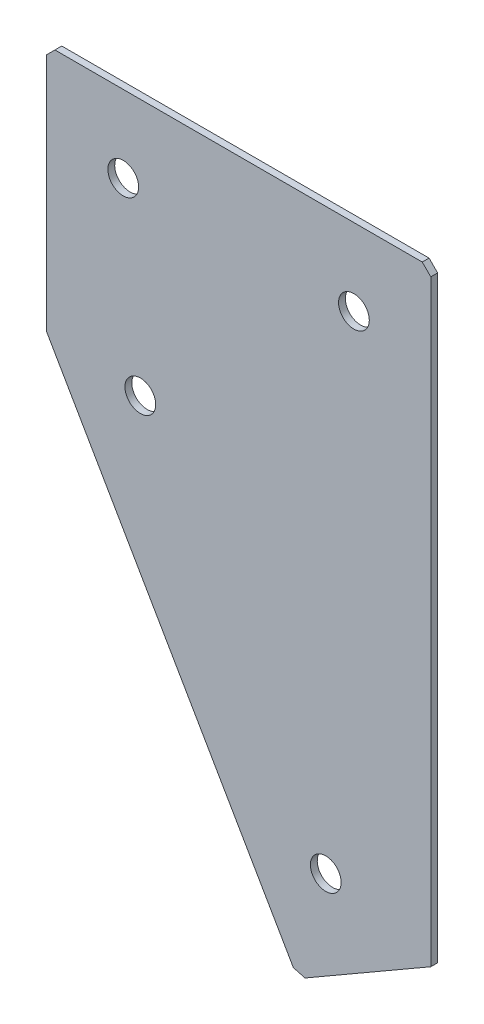
ISO-10303-21;
HEADER;
FILE_DESCRIPTION(('STEP AP214'),'2;1');
FILE_NAME('part.step','',(''),(''),'','','');
FILE_SCHEMA(('AUTOMOTIVE_DESIGN { 1 0 10303 214 1 1 1 1 }'));
ENDSEC;
DATA;
#1=APPLICATION_CONTEXT('core data for automotive mechanical design processes');
#2=APPLICATION_PROTOCOL_DEFINITION('international standard','automotive_design',2000,#1);
#3=PRODUCT_CONTEXT('',#1,'mechanical');
#4=PRODUCT('Part','Part','',(#3));
#5=PRODUCT_RELATED_PRODUCT_CATEGORY('part','',(#4));
#6=PRODUCT_DEFINITION_FORMATION('','',#4);
#7=PRODUCT_DEFINITION_CONTEXT('part definition',#1,'design');
#8=PRODUCT_DEFINITION('design','',#6,#7);
#9=PRODUCT_DEFINITION_SHAPE('','',#8);
#10=(LENGTH_UNIT() NAMED_UNIT(*) SI_UNIT(.MILLI.,.METRE.));
#11=(NAMED_UNIT(*) PLANE_ANGLE_UNIT() SI_UNIT($,.RADIAN.));
#12=(NAMED_UNIT(*) SI_UNIT($,.STERADIAN.) SOLID_ANGLE_UNIT());
#13=UNCERTAINTY_MEASURE_WITH_UNIT(LENGTH_MEASURE(1.E-05),#10,'distance_accuracy_value','');
#14=(GEOMETRIC_REPRESENTATION_CONTEXT(3) GLOBAL_UNCERTAINTY_ASSIGNED_CONTEXT((#13)) GLOBAL_UNIT_ASSIGNED_CONTEXT((#10,
#11,#12)) REPRESENTATION_CONTEXT('',''));
#15=CARTESIAN_POINT('',(0.,0.,0.));
#16=DIRECTION('',(0.,0.,1.));
#17=DIRECTION('',(1.,0.,0.));
#18=AXIS2_PLACEMENT_3D('',#15,#16,#17);
#19=CARTESIAN_POINT('',(0.,0.,-2.));
#20=DIRECTION('',(1.,0.,0.));
#21=DIRECTION('',(0.,0.,-1.));
#22=AXIS2_PLACEMENT_3D('',#19,#20,#21);
#23=PLANE('',#22);
#24=DIRECTION('',(0.,1.,0.));
#25=VECTOR('',#24,1.);
#26=CARTESIAN_POINT('',(0.,0.,0.));
#27=LINE('',#26,#25);
#28=CARTESIAN_POINT('',(0.,-72.5,0.));
#29=VERTEX_POINT('',#28);
#30=CARTESIAN_POINT('',(0.,-2.5,0.));
#31=VERTEX_POINT('',#30);
#32=EDGE_CURVE('E137',#29,#31,#27,.T.);
#33=ORIENTED_EDGE('',*,*,#32,.T.);
#34=DIRECTION('',(0.,0.,-1.));
#35=VECTOR('',#34,1.);
#36=CARTESIAN_POINT('',(0.,-2.5,-2.));
#37=LINE('',#36,#35);
#38=CARTESIAN_POINT('',(0.,-2.5,-2.));
#39=VERTEX_POINT('',#38);
#40=EDGE_CURVE('E11',#31,#39,#37,.T.);
#41=ORIENTED_EDGE('',*,*,#40,.T.);
#42=DIRECTION('',(0.,1.,0.));
#43=VECTOR('',#42,1.);
#44=CARTESIAN_POINT('',(0.,0.,-2.));
#45=LINE('',#44,#43);
#46=CARTESIAN_POINT('',(0.,-72.5,-2.));
#47=VERTEX_POINT('',#46);
#48=EDGE_CURVE('E153',#47,#39,#45,.T.);
#49=ORIENTED_EDGE('',*,*,#48,.F.);
#50=DIRECTION('',(0.,0.,1.));
#51=VECTOR('',#50,1.);
#52=CARTESIAN_POINT('',(0.,-72.5,-2.));
#53=LINE('',#52,#51);
#54=EDGE_CURVE('E125',#47,#29,#53,.T.);
#55=ORIENTED_EDGE('',*,*,#54,.T.);
#56=EDGE_LOOP('',(#33,#41,#49,#55));
#57=FACE_BOUND('',#56,.T.);
#58=ADVANCED_FACE('F39',(#57),#23,.F.);
#59=CARTESIAN_POINT('',(0.,0.,-2.));
#60=DIRECTION('',(0.,-1.,0.));
#61=DIRECTION('',(0.,0.,-1.));
#62=AXIS2_PLACEMENT_3D('',#59,#60,#61);
#63=PLANE('',#62);
#64=DIRECTION('',(1.,0.,0.));
#65=VECTOR('',#64,1.);
#66=CARTESIAN_POINT('',(0.,0.,0.));
#67=LINE('',#66,#65);
#68=CARTESIAN_POINT('',(2.5,0.,0.));
#69=VERTEX_POINT('',#68);
#70=CARTESIAN_POINT('',(110.,0.,0.));
#71=VERTEX_POINT('',#70);
#72=EDGE_CURVE('E141',#69,#71,#67,.T.);
#73=ORIENTED_EDGE('',*,*,#72,.T.);
#74=DIRECTION('',(0.,0.,-1.));
#75=VECTOR('',#74,1.);
#76=CARTESIAN_POINT('',(110.,0.,-2.));
#77=LINE('',#76,#75);
#78=CARTESIAN_POINT('',(110.,0.,-2.));
#79=VERTEX_POINT('',#78);
#80=EDGE_CURVE('E48',#71,#79,#77,.T.);
#81=ORIENTED_EDGE('',*,*,#80,.T.);
#82=DIRECTION('',(1.,0.,0.));
#83=VECTOR('',#82,1.);
#84=CARTESIAN_POINT('',(0.,0.,-2.));
#85=LINE('',#84,#83);
#86=CARTESIAN_POINT('',(2.5,0.,-2.));
#87=VERTEX_POINT('',#86);
#88=EDGE_CURVE('E113',#87,#79,#85,.T.);
#89=ORIENTED_EDGE('',*,*,#88,.F.);
#90=DIRECTION('',(0.,0.,1.));
#91=VECTOR('',#90,1.);
#92=CARTESIAN_POINT('',(2.5,0.,-2.));
#93=LINE('',#92,#91);
#94=EDGE_CURVE('E182',#87,#69,#93,.T.);
#95=ORIENTED_EDGE('',*,*,#94,.T.);
#96=EDGE_LOOP('',(#73,#81,#89,#95));
#97=FACE_BOUND('',#96,.T.);
#98=ADVANCED_FACE('F188',(#97),#63,.F.);
#99=CARTESIAN_POINT('',(112.5,0.,-2.));
#100=DIRECTION('',(-1.,0.,0.));
#101=DIRECTION('',(0.,-1.,0.));
#102=AXIS2_PLACEMENT_3D('',#99,#100,#101);
#103=PLANE('',#102);
#104=DIRECTION('',(0.,-1.,0.));
#105=VECTOR('',#104,1.);
#106=CARTESIAN_POINT('',(112.5,0.,-2.));
#107=LINE('',#106,#105);
#108=CARTESIAN_POINT('',(112.5,-2.50000000000001,-2.));
#109=VERTEX_POINT('',#108);
#110=CARTESIAN_POINT('',(112.5,-177.3557158515,-2.));
#111=VERTEX_POINT('',#110);
#112=EDGE_CURVE('E103',#109,#111,#107,.T.);
#113=ORIENTED_EDGE('',*,*,#112,.F.);
#114=DIRECTION('',(0.,0.,1.));
#115=VECTOR('',#114,1.);
#116=CARTESIAN_POINT('',(112.5,-2.50000000000001,-2.));
#117=LINE('',#116,#115);
#118=CARTESIAN_POINT('',(112.5,-2.50000000000001,0.));
#119=VERTEX_POINT('',#118);
#120=EDGE_CURVE('E179',#109,#119,#117,.T.);
#121=ORIENTED_EDGE('',*,*,#120,.T.);
#122=DIRECTION('',(0.,-1.,0.));
#123=VECTOR('',#122,1.);
#124=CARTESIAN_POINT('',(112.5,0.,0.));
#125=LINE('',#124,#123);
#126=CARTESIAN_POINT('',(112.5,-177.3557158515,0.));
#127=VERTEX_POINT('',#126);
#128=EDGE_CURVE('E119',#119,#127,#125,.T.);
#129=ORIENTED_EDGE('',*,*,#128,.T.);
#130=DIRECTION('',(0.,0.,1.));
#131=VECTOR('',#130,1.);
#132=CARTESIAN_POINT('',(112.5,-177.3557158515,-2.));
#133=LINE('',#132,#131);
#134=EDGE_CURVE('E116',#111,#127,#133,.T.);
#135=ORIENTED_EDGE('',*,*,#134,.F.);
#136=EDGE_LOOP('',(#113,#121,#129,#135));
#137=FACE_BOUND('',#136,.T.);
#138=ADVANCED_FACE('F117',(#137),#103,.F.);
#139=CARTESIAN_POINT('',(73.5288568297005,-199.8557158515,-2.));
#140=DIRECTION('',(-0.499999999999998,0.86602540378444,0.));
#141=DIRECTION('',(-0.86602540378444,-0.499999999999998,0.));
#142=AXIS2_PLACEMENT_3D('',#139,#140,#141);
#143=PLANE('',#142);
#144=DIRECTION('',(-0.86602540378444,-0.499999999999998,0.));
#145=VECTOR('',#144,1.);
#146=CARTESIAN_POINT('',(73.5288568297005,-199.8557158515,0.));
#147=LINE('',#146,#145);
#148=CARTESIAN_POINT('',(75.6939203391616,-198.6057158515,0.));
#149=VERTEX_POINT('',#148);
#150=EDGE_CURVE('E147',#127,#149,#147,.T.);
#151=ORIENTED_EDGE('',*,*,#150,.T.);
#152=DIRECTION('',(0.,0.,-1.));
#153=VECTOR('',#152,1.);
#154=CARTESIAN_POINT('',(75.6939203391616,-198.6057158515,-2.));
#155=LINE('',#154,#153);
#156=CARTESIAN_POINT('',(75.6939203391616,-198.6057158515,-2.));
#157=VERTEX_POINT('',#156);
#158=EDGE_CURVE('E129',#149,#157,#155,.T.);
#159=ORIENTED_EDGE('',*,*,#158,.T.);
#160=DIRECTION('',(-0.86602540378444,-0.499999999999998,0.));
#161=VECTOR('',#160,1.);
#162=CARTESIAN_POINT('',(73.5288568297005,-199.8557158515,-2.));
#163=LINE('',#162,#161);
#164=EDGE_CURVE('E107',#111,#157,#163,.T.);
#165=ORIENTED_EDGE('',*,*,#164,.F.);
#166=ORIENTED_EDGE('',*,*,#134,.T.);
#167=EDGE_LOOP('',(#151,#159,#165,#166));
#168=FACE_BOUND('',#167,.T.);
#169=ADVANCED_FACE('F127',(#168),#143,.F.);
#170=CARTESIAN_POINT('',(0.,-72.5,-2.));
#171=DIRECTION('',(0.86602540378444,0.499999999999998,0.));
#172=DIRECTION('',(-0.499999999999998,0.86602540378444,0.));
#173=AXIS2_PLACEMENT_3D('',#170,#171,#172);
#174=PLANE('',#173);
#175=DIRECTION('',(-0.499999999999998,0.86602540378444,0.));
#176=VECTOR('',#175,1.);
#177=CARTESIAN_POINT('',(0.,-72.5,-2.));
#178=LINE('',#177,#176);
#179=CARTESIAN_POINT('',(72.2788568297005,-197.690652342039,-2.));
#180=VERTEX_POINT('',#179);
#181=EDGE_CURVE('E131',#180,#47,#178,.T.);
#182=ORIENTED_EDGE('',*,*,#181,.F.);
#183=DIRECTION('',(0.,0.,1.));
#184=VECTOR('',#183,1.);
#185=CARTESIAN_POINT('',(72.2788568297005,-197.690652342039,-2.));
#186=LINE('',#185,#184);
#187=CARTESIAN_POINT('',(72.2788568297005,-197.690652342039,0.));
#188=VERTEX_POINT('',#187);
#189=EDGE_CURVE('E124',#180,#188,#186,.T.);
#190=ORIENTED_EDGE('',*,*,#189,.T.);
#191=DIRECTION('',(-0.499999999999998,0.86602540378444,0.));
#192=VECTOR('',#191,1.);
#193=CARTESIAN_POINT('',(0.,-72.5,0.));
#194=LINE('',#193,#192);
#195=EDGE_CURVE('E150',#188,#29,#194,.T.);
#196=ORIENTED_EDGE('',*,*,#195,.T.);
#197=ORIENTED_EDGE('',*,*,#54,.F.);
#198=EDGE_LOOP('',(#182,#190,#196,#197));
#199=FACE_BOUND('',#198,.T.);
#200=ADVANCED_FACE('F218',(#199),#174,.F.);
#201=CARTESIAN_POINT('',(0.,0.,-2.));
#202=DIRECTION('',(0.,0.,1.));
#203=DIRECTION('',(1.,0.,0.));
#204=AXIS2_PLACEMENT_3D('',#201,#202,#203);
#205=PLANE('',#204);
#206=CARTESIAN_POINT('',(22.5,-22.5,-2.));
#207=DIRECTION('',(0.,0.,-1.));
#208=DIRECTION('',(0.,1.,0.));
#209=AXIS2_PLACEMENT_3D('',#206,#207,#208);
#210=CIRCLE('',#209,4.5);
#211=CARTESIAN_POINT('',(22.5,-18.,-2.));
#212=VERTEX_POINT('',#211);
#213=EDGE_CURVE('E250',#212,#212,#210,.T.);
#214=ORIENTED_EDGE('',*,*,#213,.F.);
#215=EDGE_LOOP('',(#214));
#216=FACE_BOUND('',#215,.T.);
#217=CARTESIAN_POINT('',(90.,-22.5,-2.));
#218=DIRECTION('',(0.,0.,-1.));
#219=DIRECTION('',(0.,1.,0.));
#220=AXIS2_PLACEMENT_3D('',#217,#218,#219);
#221=CIRCLE('',#220,4.5);
#222=CARTESIAN_POINT('',(90.,-18.,-2.));
#223=VERTEX_POINT('',#222);
#224=EDGE_CURVE('E254',#223,#223,#221,.T.);
#225=ORIENTED_EDGE('',*,*,#224,.F.);
#226=EDGE_LOOP('',(#225));
#227=FACE_BOUND('',#226,.T.);
#228=CARTESIAN_POINT('',(27.5,-75.1313972081449,-2.));
#229=DIRECTION('',(0.,0.,-1.));
#230=DIRECTION('',(0.,1.,0.));
#231=AXIS2_PLACEMENT_3D('',#228,#229,#230);
#232=CIRCLE('',#231,4.5);
#233=CARTESIAN_POINT('',(27.5,-70.6313972081449,-2.));
#234=VERTEX_POINT('',#233);
#235=EDGE_CURVE('E264',#234,#234,#232,.T.);
#236=ORIENTED_EDGE('',*,*,#235,.F.);
#237=EDGE_LOOP('',(#236));
#238=FACE_BOUND('',#237,.T.);
#239=CARTESIAN_POINT('',(81.7644284148504,-169.12014426635,-2.00000000000001));
#240=DIRECTION('',(0.,0.,-1.));
#241=DIRECTION('',(0.,1.,0.));
#242=AXIS2_PLACEMENT_3D('',#239,#240,#241);
#243=CIRCLE('',#242,4.5);
#244=CARTESIAN_POINT('',(81.7644284148504,-164.62014426635,-2.00000000000001));
#245=VERTEX_POINT('',#244);
#246=EDGE_CURVE('E272',#245,#245,#243,.T.);
#247=ORIENTED_EDGE('',*,*,#246,.F.);
#248=EDGE_LOOP('',(#247));
#249=FACE_BOUND('',#248,.T.);
#250=ORIENTED_EDGE('',*,*,#164,.T.);
#251=DIRECTION('',(0.965925826289068,-0.258819045102522,0.));
#252=VECTOR('',#251,1.);
#253=CARTESIAN_POINT('',(72.2788568297005,-197.690652342039,-2.));
#254=LINE('',#253,#252);
#255=EDGE_CURVE('E176',#157,#180,#254,.F.);
#256=ORIENTED_EDGE('',*,*,#255,.T.);
#257=ORIENTED_EDGE('',*,*,#181,.T.);
#258=ORIENTED_EDGE('',*,*,#48,.T.);
#259=DIRECTION('',(-0.707106781186548,-0.707106781186548,0.));
#260=VECTOR('',#259,1.);
#261=CARTESIAN_POINT('',(2.5,0.,-2.));
#262=LINE('',#261,#260);
#263=EDGE_CURVE('E171',#39,#87,#262,.F.);
#264=ORIENTED_EDGE('',*,*,#263,.T.);
#265=ORIENTED_EDGE('',*,*,#88,.T.);
#266=DIRECTION('',(-0.707106781186548,0.707106781186548,0.));
#267=VECTOR('',#266,1.);
#268=CARTESIAN_POINT('',(112.5,-2.5,-2.));
#269=LINE('',#268,#267);
#270=EDGE_CURVE('E55',#79,#109,#269,.F.);
#271=ORIENTED_EDGE('',*,*,#270,.T.);
#272=ORIENTED_EDGE('',*,*,#112,.T.);
#273=EDGE_LOOP('',(#250,#256,#257,#258,#264,#265,#271,#272));
#274=FACE_BOUND('',#273,.T.);
#275=ADVANCED_FACE('F105',(#216,#227,#238,#249,#274),#205,.F.);
#276=CARTESIAN_POINT('',(0.,0.,0.));
#277=DIRECTION('',(0.,0.,1.));
#278=DIRECTION('',(1.,0.,0.));
#279=AXIS2_PLACEMENT_3D('',#276,#277,#278);
#280=PLANE('',#279);
#281=CARTESIAN_POINT('',(22.5,-22.5,0.));
#282=DIRECTION('',(0.,0.,-1.));
#283=DIRECTION('',(0.,1.,0.));
#284=AXIS2_PLACEMENT_3D('',#281,#282,#283);
#285=CIRCLE('',#284,4.5);
#286=CARTESIAN_POINT('',(22.5,-18.,0.));
#287=VERTEX_POINT('',#286);
#288=EDGE_CURVE('E247',#287,#287,#285,.T.);
#289=ORIENTED_EDGE('',*,*,#288,.T.);
#290=EDGE_LOOP('',(#289));
#291=FACE_BOUND('',#290,.T.);
#292=CARTESIAN_POINT('',(90.,-22.5,0.));
#293=DIRECTION('',(0.,0.,-1.));
#294=DIRECTION('',(0.,1.,0.));
#295=AXIS2_PLACEMENT_3D('',#292,#293,#294);
#296=CIRCLE('',#295,4.5);
#297=CARTESIAN_POINT('',(90.,-18.,0.));
#298=VERTEX_POINT('',#297);
#299=EDGE_CURVE('E260',#298,#298,#296,.T.);
#300=ORIENTED_EDGE('',*,*,#299,.T.);
#301=EDGE_LOOP('',(#300));
#302=FACE_BOUND('',#301,.T.);
#303=CARTESIAN_POINT('',(27.5,-75.1313972081449,0.));
#304=DIRECTION('',(0.,0.,-1.));
#305=DIRECTION('',(0.,1.,0.));
#306=AXIS2_PLACEMENT_3D('',#303,#304,#305);
#307=CIRCLE('',#306,4.5);
#308=CARTESIAN_POINT('',(27.5,-70.6313972081449,0.));
#309=VERTEX_POINT('',#308);
#310=EDGE_CURVE('E268',#309,#309,#307,.T.);
#311=ORIENTED_EDGE('',*,*,#310,.T.);
#312=EDGE_LOOP('',(#311));
#313=FACE_BOUND('',#312,.T.);
#314=CARTESIAN_POINT('',(81.7644284148504,-169.12014426635,0.));
#315=DIRECTION('',(0.,0.,-1.));
#316=DIRECTION('',(0.,1.,0.));
#317=AXIS2_PLACEMENT_3D('',#314,#315,#316);
#318=CIRCLE('',#317,4.5);
#319=CARTESIAN_POINT('',(81.7644284148504,-164.62014426635,0.));
#320=VERTEX_POINT('',#319);
#321=EDGE_CURVE('E142',#320,#320,#318,.T.);
#322=ORIENTED_EDGE('',*,*,#321,.T.);
#323=EDGE_LOOP('',(#322));
#324=FACE_BOUND('',#323,.T.);
#325=ORIENTED_EDGE('',*,*,#195,.F.);
#326=DIRECTION('',(-0.965925826289068,0.258819045102522,0.));
#327=VECTOR('',#326,1.);
#328=CARTESIAN_POINT('',(-44.5808977561692,-166.378175473056,0.));
#329=LINE('',#328,#327);
#330=EDGE_CURVE('E166',#188,#149,#329,.F.);
#331=ORIENTED_EDGE('',*,*,#330,.T.);
#332=ORIENTED_EDGE('',*,*,#150,.F.);
#333=ORIENTED_EDGE('',*,*,#128,.F.);
#334=DIRECTION('',(0.707106781186548,-0.707106781186548,0.));
#335=VECTOR('',#334,1.);
#336=CARTESIAN_POINT('',(55.,55.,0.));
#337=LINE('',#336,#335);
#338=EDGE_CURVE('E163',#119,#71,#337,.F.);
#339=ORIENTED_EDGE('',*,*,#338,.T.);
#340=ORIENTED_EDGE('',*,*,#72,.F.);
#341=DIRECTION('',(0.707106781186548,0.707106781186548,0.));
#342=VECTOR('',#341,1.);
#343=CARTESIAN_POINT('',(1.25,-1.25,0.));
#344=LINE('',#343,#342);
#345=EDGE_CURVE('E160',#69,#31,#344,.F.);
#346=ORIENTED_EDGE('',*,*,#345,.T.);
#347=ORIENTED_EDGE('',*,*,#32,.F.);
#348=EDGE_LOOP('',(#325,#331,#332,#333,#339,#340,#346,#347));
#349=FACE_BOUND('',#348,.T.);
#350=ADVANCED_FACE('F193',(#291,#302,#313,#324,#349),#280,.T.);
#351=CARTESIAN_POINT('',(81.7644284148504,-169.12014426635,-2.00000000000001));
#352=DIRECTION('',(0.,0.,-1.));
#353=DIRECTION('',(0.,1.,0.));
#354=AXIS2_PLACEMENT_3D('',#351,#352,#353);
#355=CYLINDRICAL_SURFACE('',#354,4.5);
#356=ORIENTED_EDGE('',*,*,#321,.F.);
#357=EDGE_LOOP('',(#356));
#358=FACE_BOUND('',#357,.T.);
#359=ORIENTED_EDGE('',*,*,#246,.T.);
#360=EDGE_LOOP('',(#359));
#361=FACE_BOUND('',#360,.T.);
#362=ADVANCED_FACE('F224',(#358,#361),#355,.F.);
#363=CARTESIAN_POINT('',(27.5,-75.1313972081449,-2.));
#364=DIRECTION('',(0.,0.,-1.));
#365=DIRECTION('',(0.,1.,0.));
#366=AXIS2_PLACEMENT_3D('',#363,#364,#365);
#367=CYLINDRICAL_SURFACE('',#366,4.5);
#368=ORIENTED_EDGE('',*,*,#310,.F.);
#369=EDGE_LOOP('',(#368));
#370=FACE_BOUND('',#369,.T.);
#371=ORIENTED_EDGE('',*,*,#235,.T.);
#372=EDGE_LOOP('',(#371));
#373=FACE_BOUND('',#372,.T.);
#374=ADVANCED_FACE('F231',(#370,#373),#367,.F.);
#375=CARTESIAN_POINT('',(90.,-22.5,-2.));
#376=DIRECTION('',(0.,0.,-1.));
#377=DIRECTION('',(0.,1.,0.));
#378=AXIS2_PLACEMENT_3D('',#375,#376,#377);
#379=CYLINDRICAL_SURFACE('',#378,4.5);
#380=ORIENTED_EDGE('',*,*,#299,.F.);
#381=EDGE_LOOP('',(#380));
#382=FACE_BOUND('',#381,.T.);
#383=ORIENTED_EDGE('',*,*,#224,.T.);
#384=EDGE_LOOP('',(#383));
#385=FACE_BOUND('',#384,.T.);
#386=ADVANCED_FACE('F235',(#382,#385),#379,.F.);
#387=CARTESIAN_POINT('',(22.5,-22.5,-2.));
#388=DIRECTION('',(0.,0.,-1.));
#389=DIRECTION('',(0.,1.,0.));
#390=AXIS2_PLACEMENT_3D('',#387,#388,#389);
#391=CYLINDRICAL_SURFACE('',#390,4.5);
#392=ORIENTED_EDGE('',*,*,#288,.F.);
#393=EDGE_LOOP('',(#392));
#394=FACE_BOUND('',#393,.T.);
#395=ORIENTED_EDGE('',*,*,#213,.T.);
#396=EDGE_LOOP('',(#395));
#397=FACE_BOUND('',#396,.T.);
#398=ADVANCED_FACE('F203',(#394,#397),#391,.F.);
#399=CARTESIAN_POINT('',(72.2788568297005,-197.690652342039,-2.));
#400=DIRECTION('',(0.258819045102522,0.965925826289068,0.));
#401=DIRECTION('',(0.,0.,1.));
#402=AXIS2_PLACEMENT_3D('',#399,#400,#401);
#403=PLANE('',#402);
#404=ORIENTED_EDGE('',*,*,#255,.F.);
#405=ORIENTED_EDGE('',*,*,#158,.F.);
#406=ORIENTED_EDGE('',*,*,#330,.F.);
#407=ORIENTED_EDGE('',*,*,#189,.F.);
#408=EDGE_LOOP('',(#404,#405,#406,#407));
#409=FACE_BOUND('',#408,.T.);
#410=ADVANCED_FACE('F198',(#409),#403,.F.);
#411=CARTESIAN_POINT('',(112.5,-2.5,-2.));
#412=DIRECTION('',(-0.707106781186547,-0.707106781186547,0.));
#413=DIRECTION('',(0.,0.,1.));
#414=AXIS2_PLACEMENT_3D('',#411,#412,#413);
#415=PLANE('',#414);
#416=ORIENTED_EDGE('',*,*,#270,.F.);
#417=ORIENTED_EDGE('',*,*,#80,.F.);
#418=ORIENTED_EDGE('',*,*,#338,.F.);
#419=ORIENTED_EDGE('',*,*,#120,.F.);
#420=EDGE_LOOP('',(#416,#417,#418,#419));
#421=FACE_BOUND('',#420,.T.);
#422=ADVANCED_FACE('F196',(#421),#415,.F.);
#423=CARTESIAN_POINT('',(2.5,0.,-2.));
#424=DIRECTION('',(0.707106781186547,-0.707106781186547,0.));
#425=DIRECTION('',(0.,0.,1.));
#426=AXIS2_PLACEMENT_3D('',#423,#424,#425);
#427=PLANE('',#426);
#428=ORIENTED_EDGE('',*,*,#263,.F.);
#429=ORIENTED_EDGE('',*,*,#40,.F.);
#430=ORIENTED_EDGE('',*,*,#345,.F.);
#431=ORIENTED_EDGE('',*,*,#94,.F.);
#432=EDGE_LOOP('',(#428,#429,#430,#431));
#433=FACE_BOUND('',#432,.T.);
#434=ADVANCED_FACE('F41',(#433),#427,.F.);
#435=CLOSED_SHELL('',(#58,#98,#138,#169,#200,#275,#350,#362,#374,#386,#398,#410,#422,#434));
#436=MANIFOLD_SOLID_BREP('B2',#435);
#437=ADVANCED_BREP_SHAPE_REPRESENTATION('',(#18,#436),#14);
#438=SHAPE_DEFINITION_REPRESENTATION(#9,#437);
ENDSEC;
END-ISO-10303-21;
